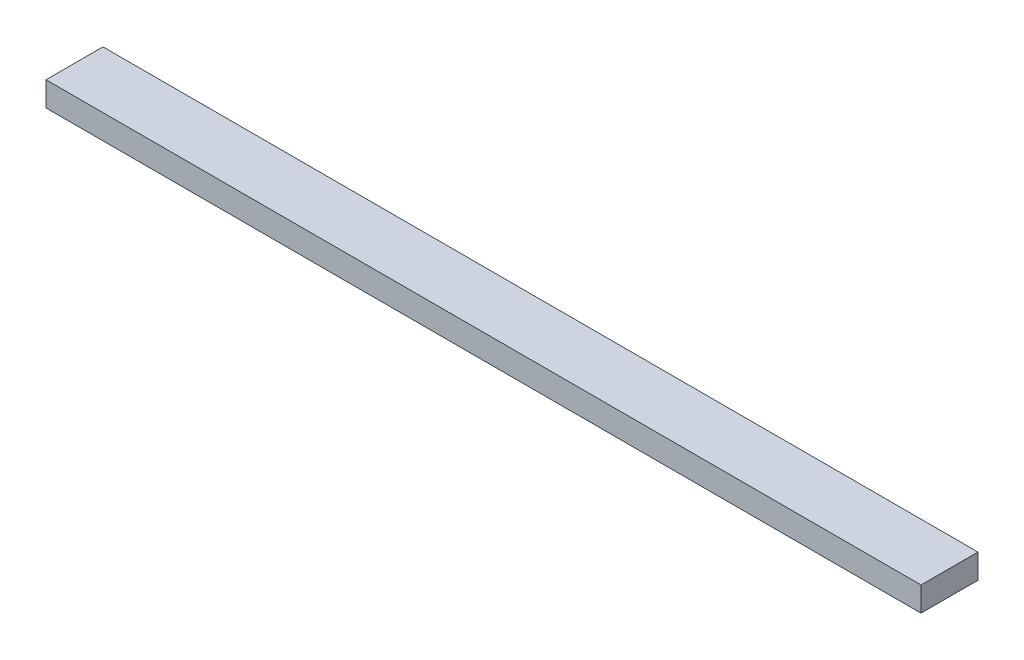
ISO-10303-21;
HEADER;
FILE_DESCRIPTION(('STEP AP214'),'2;1');
FILE_NAME('part.step','',(''),(''),'','','');
FILE_SCHEMA(('AUTOMOTIVE_DESIGN { 1 0 10303 214 1 1 1 1 }'));
ENDSEC;
DATA;
#1=APPLICATION_CONTEXT('core data for automotive mechanical design processes');
#2=APPLICATION_PROTOCOL_DEFINITION('international standard','automotive_design',2000,#1);
#3=PRODUCT_CONTEXT('',#1,'mechanical');
#4=PRODUCT('Part','Part','',(#3));
#5=PRODUCT_RELATED_PRODUCT_CATEGORY('part','',(#4));
#6=PRODUCT_DEFINITION_FORMATION('','',#4);
#7=PRODUCT_DEFINITION_CONTEXT('part definition',#1,'design');
#8=PRODUCT_DEFINITION('design','',#6,#7);
#9=PRODUCT_DEFINITION_SHAPE('','',#8);
#10=(LENGTH_UNIT() NAMED_UNIT(*) SI_UNIT(.MILLI.,.METRE.));
#11=(NAMED_UNIT(*) PLANE_ANGLE_UNIT() SI_UNIT($,.RADIAN.));
#12=(NAMED_UNIT(*) SI_UNIT($,.STERADIAN.) SOLID_ANGLE_UNIT());
#13=UNCERTAINTY_MEASURE_WITH_UNIT(LENGTH_MEASURE(1.E-05),#10,'distance_accuracy_value','');
#14=(GEOMETRIC_REPRESENTATION_CONTEXT(3) GLOBAL_UNCERTAINTY_ASSIGNED_CONTEXT((#13)) GLOBAL_UNIT_ASSIGNED_CONTEXT((#10,
#11,#12)) REPRESENTATION_CONTEXT('',''));
#15=CARTESIAN_POINT('',(0.,0.,0.));
#16=DIRECTION('',(0.,0.,1.));
#17=DIRECTION('',(1.,0.,0.));
#18=AXIS2_PLACEMENT_3D('',#15,#16,#17);
#19=CARTESIAN_POINT('',(0.,38.1,0.));
#20=DIRECTION('',(1.,0.,0.));
#21=DIRECTION('',(0.,0.,-1.));
#22=AXIS2_PLACEMENT_3D('',#19,#20,#21);
#23=PLANE('',#22);
#24=DIRECTION('',(0.,0.,1.));
#25=VECTOR('',#24,1.);
#26=CARTESIAN_POINT('',(0.,0.,0.));
#27=LINE('',#26,#25);
#28=CARTESIAN_POINT('',(0.,0.,-88.9));
#29=VERTEX_POINT('',#28);
#30=CARTESIAN_POINT('',(0.,0.,0.));
#31=VERTEX_POINT('',#30);
#32=EDGE_CURVE('E102',#29,#31,#27,.T.);
#33=ORIENTED_EDGE('',*,*,#32,.T.);
#34=DIRECTION('',(0.,-1.,0.));
#35=VECTOR('',#34,1.);
#36=CARTESIAN_POINT('',(0.,38.1,0.));
#37=LINE('',#36,#35);
#38=CARTESIAN_POINT('',(0.,38.1,0.));
#39=VERTEX_POINT('',#38);
#40=EDGE_CURVE('E11',#39,#31,#37,.T.);
#41=ORIENTED_EDGE('',*,*,#40,.F.);
#42=DIRECTION('',(0.,0.,1.));
#43=VECTOR('',#42,1.);
#44=CARTESIAN_POINT('',(0.,38.1,0.));
#45=LINE('',#44,#43);
#46=CARTESIAN_POINT('',(0.,38.1,-88.9));
#47=VERTEX_POINT('',#46);
#48=EDGE_CURVE('E90',#47,#39,#45,.T.);
#49=ORIENTED_EDGE('',*,*,#48,.F.);
#50=DIRECTION('',(0.,-1.,0.));
#51=VECTOR('',#50,1.);
#52=CARTESIAN_POINT('',(0.,38.1,-88.9));
#53=LINE('',#52,#51);
#54=EDGE_CURVE('E98',#47,#29,#53,.T.);
#55=ORIENTED_EDGE('',*,*,#54,.T.);
#56=EDGE_LOOP('',(#33,#41,#49,#55));
#57=FACE_BOUND('',#56,.T.);
#58=ADVANCED_FACE('F39',(#57),#23,.F.);
#59=CARTESIAN_POINT('',(0.,38.1,0.));
#60=DIRECTION('',(0.,0.,-1.));
#61=DIRECTION('',(-1.,0.,0.));
#62=AXIS2_PLACEMENT_3D('',#59,#60,#61);
#63=PLANE('',#62);
#64=DIRECTION('',(1.,0.,0.));
#65=VECTOR('',#64,1.);
#66=CARTESIAN_POINT('',(0.,0.,0.));
#67=LINE('',#66,#65);
#68=CARTESIAN_POINT('',(1365.2754,0.,0.));
#69=VERTEX_POINT('',#68);
#70=EDGE_CURVE('E94',#31,#69,#67,.T.);
#71=ORIENTED_EDGE('',*,*,#70,.T.);
#72=DIRECTION('',(0.,-1.,0.));
#73=VECTOR('',#72,1.);
#74=CARTESIAN_POINT('',(1365.2754,38.1,0.));
#75=LINE('',#74,#73);
#76=CARTESIAN_POINT('',(1365.2754,38.1,0.));
#77=VERTEX_POINT('',#76);
#78=EDGE_CURVE('E47',#77,#69,#75,.T.);
#79=ORIENTED_EDGE('',*,*,#78,.F.);
#80=DIRECTION('',(1.,0.,0.));
#81=VECTOR('',#80,1.);
#82=CARTESIAN_POINT('',(0.,38.1,0.));
#83=LINE('',#82,#81);
#84=EDGE_CURVE('E85',#39,#77,#83,.T.);
#85=ORIENTED_EDGE('',*,*,#84,.F.);
#86=ORIENTED_EDGE('',*,*,#40,.T.);
#87=EDGE_LOOP('',(#71,#79,#85,#86));
#88=FACE_BOUND('',#87,.T.);
#89=ADVANCED_FACE('F93',(#88),#63,.F.);
#90=CARTESIAN_POINT('',(1365.2754,38.1,0.));
#91=DIRECTION('',(-1.,0.,0.));
#92=DIRECTION('',(0.,0.,1.));
#93=AXIS2_PLACEMENT_3D('',#90,#91,#92);
#94=PLANE('',#93);
#95=DIRECTION('',(0.,0.,-1.));
#96=VECTOR('',#95,1.);
#97=CARTESIAN_POINT('',(1365.2754,0.,0.));
#98=LINE('',#97,#96);
#99=CARTESIAN_POINT('',(1365.2754,0.,-88.9));
#100=VERTEX_POINT('',#99);
#101=EDGE_CURVE('E72',#69,#100,#98,.T.);
#102=ORIENTED_EDGE('',*,*,#101,.T.);
#103=DIRECTION('',(0.,-1.,0.));
#104=VECTOR('',#103,1.);
#105=CARTESIAN_POINT('',(1365.2754,38.1,-88.9));
#106=LINE('',#105,#104);
#107=CARTESIAN_POINT('',(1365.2754,38.1,-88.9));
#108=VERTEX_POINT('',#107);
#109=EDGE_CURVE('E95',#108,#100,#106,.T.);
#110=ORIENTED_EDGE('',*,*,#109,.F.);
#111=DIRECTION('',(0.,0.,-1.));
#112=VECTOR('',#111,1.);
#113=CARTESIAN_POINT('',(1365.2754,38.1,0.));
#114=LINE('',#113,#112);
#115=EDGE_CURVE('E88',#77,#108,#114,.T.);
#116=ORIENTED_EDGE('',*,*,#115,.F.);
#117=ORIENTED_EDGE('',*,*,#78,.T.);
#118=EDGE_LOOP('',(#102,#110,#116,#117));
#119=FACE_BOUND('',#118,.T.);
#120=ADVANCED_FACE('F96',(#119),#94,.F.);
#121=CARTESIAN_POINT('',(0.,38.1,-88.9));
#122=DIRECTION('',(0.,0.,1.));
#123=DIRECTION('',(1.,0.,0.));
#124=AXIS2_PLACEMENT_3D('',#121,#122,#123);
#125=PLANE('',#124);
#126=DIRECTION('',(-1.,0.,0.));
#127=VECTOR('',#126,1.);
#128=CARTESIAN_POINT('',(0.,0.,-88.9));
#129=LINE('',#128,#127);
#130=EDGE_CURVE('E78',#100,#29,#129,.T.);
#131=ORIENTED_EDGE('',*,*,#130,.T.);
#132=ORIENTED_EDGE('',*,*,#54,.F.);
#133=DIRECTION('',(-1.,0.,0.));
#134=VECTOR('',#133,1.);
#135=CARTESIAN_POINT('',(0.,38.1,-88.9));
#136=LINE('',#135,#134);
#137=EDGE_CURVE('E55',#108,#47,#136,.T.);
#138=ORIENTED_EDGE('',*,*,#137,.F.);
#139=ORIENTED_EDGE('',*,*,#109,.T.);
#140=EDGE_LOOP('',(#131,#132,#138,#139));
#141=FACE_BOUND('',#140,.T.);
#142=ADVANCED_FACE('F109',(#141),#125,.F.);
#143=CARTESIAN_POINT('',(0.,38.1,0.));
#144=DIRECTION('',(0.,-1.,0.));
#145=DIRECTION('',(0.,0.,-1.));
#146=AXIS2_PLACEMENT_3D('',#143,#144,#145);
#147=PLANE('',#146);
#148=ORIENTED_EDGE('',*,*,#48,.T.);
#149=ORIENTED_EDGE('',*,*,#84,.T.);
#150=ORIENTED_EDGE('',*,*,#115,.T.);
#151=ORIENTED_EDGE('',*,*,#137,.T.);
#152=EDGE_LOOP('',(#148,#149,#150,#151));
#153=FACE_BOUND('',#152,.T.);
#154=ADVANCED_FACE('F86',(#153),#147,.F.);
#155=CARTESIAN_POINT('',(0.,0.,0.));
#156=DIRECTION('',(0.,-1.,0.));
#157=DIRECTION('',(0.,0.,-1.));
#158=AXIS2_PLACEMENT_3D('',#155,#156,#157);
#159=PLANE('',#158);
#160=ORIENTED_EDGE('',*,*,#32,.F.);
#161=ORIENTED_EDGE('',*,*,#130,.F.);
#162=ORIENTED_EDGE('',*,*,#101,.F.);
#163=ORIENTED_EDGE('',*,*,#70,.F.);
#164=EDGE_LOOP('',(#160,#161,#162,#163));
#165=FACE_BOUND('',#164,.T.);
#166=ADVANCED_FACE('F112',(#165),#159,.T.);
#167=CLOSED_SHELL('',(#58,#89,#120,#142,#154,#166));
#168=MANIFOLD_SOLID_BREP('B2',#167);
#169=ADVANCED_BREP_SHAPE_REPRESENTATION('',(#18,#168),#14);
#170=SHAPE_DEFINITION_REPRESENTATION(#9,#169);
ENDSEC;
END-ISO-10303-21;
